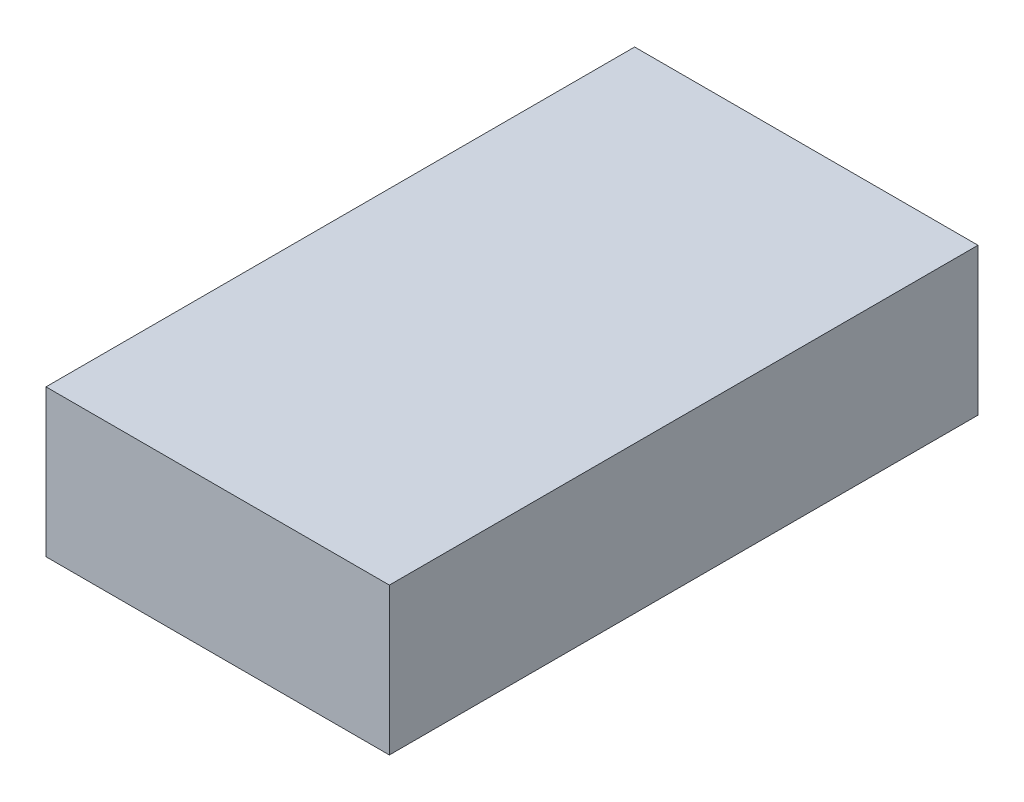
ISO-10303-21;
HEADER;
FILE_DESCRIPTION(('STEP AP214'),'2;1');
FILE_NAME('part.step','',(''),(''),'','','');
FILE_SCHEMA(('AUTOMOTIVE_DESIGN { 1 0 10303 214 1 1 1 1 }'));
ENDSEC;
DATA;
#1=APPLICATION_CONTEXT('core data for automotive mechanical design processes');
#2=APPLICATION_PROTOCOL_DEFINITION('international standard','automotive_design',2000,#1);
#3=PRODUCT_CONTEXT('',#1,'mechanical');
#4=PRODUCT('Part','Part','',(#3));
#5=PRODUCT_RELATED_PRODUCT_CATEGORY('part','',(#4));
#6=PRODUCT_DEFINITION_FORMATION('','',#4);
#7=PRODUCT_DEFINITION_CONTEXT('part definition',#1,'design');
#8=PRODUCT_DEFINITION('design','',#6,#7);
#9=PRODUCT_DEFINITION_SHAPE('','',#8);
#10=(LENGTH_UNIT() NAMED_UNIT(*) SI_UNIT(.MILLI.,.METRE.));
#11=(NAMED_UNIT(*) PLANE_ANGLE_UNIT() SI_UNIT($,.RADIAN.));
#12=(NAMED_UNIT(*) SI_UNIT($,.STERADIAN.) SOLID_ANGLE_UNIT());
#13=UNCERTAINTY_MEASURE_WITH_UNIT(LENGTH_MEASURE(1.E-05),#10,'distance_accuracy_value','');
#14=(GEOMETRIC_REPRESENTATION_CONTEXT(3) GLOBAL_UNCERTAINTY_ASSIGNED_CONTEXT((#13)) GLOBAL_UNIT_ASSIGNED_CONTEXT((#10,
#11,#12)) REPRESENTATION_CONTEXT('',''));
#15=CARTESIAN_POINT('',(0.,0.,0.));
#16=DIRECTION('',(0.,0.,1.));
#17=DIRECTION('',(1.,0.,0.));
#18=AXIS2_PLACEMENT_3D('',#15,#16,#17);
#19=CARTESIAN_POINT('',(0.,15.,0.));
#20=DIRECTION('',(0.,1.,0.));
#21=DIRECTION('',(0.,0.,1.));
#22=AXIS2_PLACEMENT_3D('',#19,#20,#21);
#23=PLANE('',#22);
#24=DIRECTION('',(-1.,0.,0.));
#25=VECTOR('',#24,1.);
#26=CARTESIAN_POINT('',(17.,15.,-30.));
#27=LINE('',#26,#25);
#28=CARTESIAN_POINT('',(-18.,15.,-30.));
#29=VERTEX_POINT('',#28);
#30=CARTESIAN_POINT('',(17.,15.,-30.));
#31=VERTEX_POINT('',#30);
#32=EDGE_CURVE('E68',#29,#31,#27,.F.);
#33=ORIENTED_EDGE('',*,*,#32,.F.);
#34=DIRECTION('',(0.,0.,1.));
#35=VECTOR('',#34,1.);
#36=CARTESIAN_POINT('',(-18.,15.,-30.));
#37=LINE('',#36,#35);
#38=CARTESIAN_POINT('',(-18.,15.,30.));
#39=VERTEX_POINT('',#38);
#40=EDGE_CURVE('E20',#39,#29,#37,.F.);
#41=ORIENTED_EDGE('',*,*,#40,.F.);
#42=DIRECTION('',(1.,0.,0.));
#43=VECTOR('',#42,1.);
#44=CARTESIAN_POINT('',(-18.,15.,30.));
#45=LINE('',#44,#43);
#46=CARTESIAN_POINT('',(17.,15.,30.));
#47=VERTEX_POINT('',#46);
#48=EDGE_CURVE('E58',#47,#39,#45,.F.);
#49=ORIENTED_EDGE('',*,*,#48,.F.);
#50=DIRECTION('',(0.,0.,-1.));
#51=VECTOR('',#50,1.);
#52=CARTESIAN_POINT('',(17.,15.,30.));
#53=LINE('',#52,#51);
#54=EDGE_CURVE('E53',#31,#47,#53,.F.);
#55=ORIENTED_EDGE('',*,*,#54,.F.);
#56=EDGE_LOOP('',(#33,#41,#49,#55));
#57=FACE_BOUND('',#56,.T.);
#58=ADVANCED_FACE('F17',(#57),#23,.T.);
#59=CARTESIAN_POINT('',(-18.,0.,-30.));
#60=DIRECTION('',(-1.,0.,0.));
#61=DIRECTION('',(0.,0.,1.));
#62=AXIS2_PLACEMENT_3D('',#59,#60,#61);
#63=PLANE('',#62);
#64=DIRECTION('',(0.,1.,0.));
#65=VECTOR('',#64,1.);
#66=CARTESIAN_POINT('',(-18.,0.,-30.));
#67=LINE('',#66,#65);
#68=CARTESIAN_POINT('',(-18.,0.,-30.));
#69=VERTEX_POINT('',#68);
#70=EDGE_CURVE('E79',#69,#29,#67,.T.);
#71=ORIENTED_EDGE('',*,*,#70,.F.);
#72=DIRECTION('',(0.,0.,1.));
#73=VECTOR('',#72,1.);
#74=CARTESIAN_POINT('',(-18.,0.,0.));
#75=LINE('',#74,#73);
#76=CARTESIAN_POINT('',(-18.,0.,30.));
#77=VERTEX_POINT('',#76);
#78=EDGE_CURVE('E74',#69,#77,#75,.T.);
#79=ORIENTED_EDGE('',*,*,#78,.T.);
#80=DIRECTION('',(0.,1.,0.));
#81=VECTOR('',#80,1.);
#82=CARTESIAN_POINT('',(-18.,0.,30.));
#83=LINE('',#82,#81);
#84=EDGE_CURVE('E63',#39,#77,#83,.F.);
#85=ORIENTED_EDGE('',*,*,#84,.F.);
#86=ORIENTED_EDGE('',*,*,#40,.T.);
#87=EDGE_LOOP('',(#71,#79,#85,#86));
#88=FACE_BOUND('',#87,.T.);
#89=ADVANCED_FACE('F73',(#88),#63,.T.);
#90=CARTESIAN_POINT('',(-18.,0.,30.));
#91=DIRECTION('',(0.,0.,1.));
#92=DIRECTION('',(1.,0.,0.));
#93=AXIS2_PLACEMENT_3D('',#90,#91,#92);
#94=PLANE('',#93);
#95=ORIENTED_EDGE('',*,*,#84,.T.);
#96=DIRECTION('',(1.,0.,0.));
#97=VECTOR('',#96,1.);
#98=CARTESIAN_POINT('',(0.,0.,30.));
#99=LINE('',#98,#97);
#100=CARTESIAN_POINT('',(17.,0.,30.));
#101=VERTEX_POINT('',#100);
#102=EDGE_CURVE('E84',#77,#101,#99,.T.);
#103=ORIENTED_EDGE('',*,*,#102,.T.);
#104=DIRECTION('',(0.,1.,0.));
#105=VECTOR('',#104,1.);
#106=CARTESIAN_POINT('',(17.,0.,30.));
#107=LINE('',#106,#105);
#108=EDGE_CURVE('E65',#47,#101,#107,.F.);
#109=ORIENTED_EDGE('',*,*,#108,.F.);
#110=ORIENTED_EDGE('',*,*,#48,.T.);
#111=EDGE_LOOP('',(#95,#103,#109,#110));
#112=FACE_BOUND('',#111,.T.);
#113=ADVANCED_FACE('F60',(#112),#94,.T.);
#114=CARTESIAN_POINT('',(17.,0.,30.));
#115=DIRECTION('',(1.,0.,0.));
#116=DIRECTION('',(0.,0.,-1.));
#117=AXIS2_PLACEMENT_3D('',#114,#115,#116);
#118=PLANE('',#117);
#119=ORIENTED_EDGE('',*,*,#108,.T.);
#120=DIRECTION('',(0.,0.,1.));
#121=VECTOR('',#120,1.);
#122=CARTESIAN_POINT('',(17.,0.,0.));
#123=LINE('',#122,#121);
#124=CARTESIAN_POINT('',(17.,0.,-30.));
#125=VERTEX_POINT('',#124);
#126=EDGE_CURVE('E26',#101,#125,#123,.F.);
#127=ORIENTED_EDGE('',*,*,#126,.T.);
#128=DIRECTION('',(0.,1.,0.));
#129=VECTOR('',#128,1.);
#130=CARTESIAN_POINT('',(17.,0.,-30.));
#131=LINE('',#130,#129);
#132=EDGE_CURVE('E34',#31,#125,#131,.F.);
#133=ORIENTED_EDGE('',*,*,#132,.F.);
#134=ORIENTED_EDGE('',*,*,#54,.T.);
#135=EDGE_LOOP('',(#119,#127,#133,#134));
#136=FACE_BOUND('',#135,.T.);
#137=ADVANCED_FACE('F88',(#136),#118,.T.);
#138=CARTESIAN_POINT('',(17.,0.,-30.));
#139=DIRECTION('',(0.,0.,-1.));
#140=DIRECTION('',(-1.,0.,0.));
#141=AXIS2_PLACEMENT_3D('',#138,#139,#140);
#142=PLANE('',#141);
#143=ORIENTED_EDGE('',*,*,#132,.T.);
#144=DIRECTION('',(1.,0.,0.));
#145=VECTOR('',#144,1.);
#146=CARTESIAN_POINT('',(0.,0.,-30.));
#147=LINE('',#146,#145);
#148=EDGE_CURVE('E11',#125,#69,#147,.F.);
#149=ORIENTED_EDGE('',*,*,#148,.T.);
#150=ORIENTED_EDGE('',*,*,#70,.T.);
#151=ORIENTED_EDGE('',*,*,#32,.T.);
#152=EDGE_LOOP('',(#143,#149,#150,#151));
#153=FACE_BOUND('',#152,.T.);
#154=ADVANCED_FACE('F91',(#153),#142,.T.);
#155=CARTESIAN_POINT('',(0.,0.,0.));
#156=DIRECTION('',(0.,1.,0.));
#157=DIRECTION('',(0.,0.,1.));
#158=AXIS2_PLACEMENT_3D('',#155,#156,#157);
#159=PLANE('',#158);
#160=ORIENTED_EDGE('',*,*,#126,.F.);
#161=ORIENTED_EDGE('',*,*,#102,.F.);
#162=ORIENTED_EDGE('',*,*,#78,.F.);
#163=ORIENTED_EDGE('',*,*,#148,.F.);
#164=EDGE_LOOP('',(#160,#161,#162,#163));
#165=FACE_BOUND('',#164,.T.);
#166=ADVANCED_FACE('F90',(#165),#159,.F.);
#167=CLOSED_SHELL('',(#58,#89,#113,#137,#154,#166));
#168=MANIFOLD_SOLID_BREP('B1',#167);
#169=ADVANCED_BREP_SHAPE_REPRESENTATION('',(#18,#168),#14);
#170=SHAPE_DEFINITION_REPRESENTATION(#9,#169);
ENDSEC;
END-ISO-10303-21;
